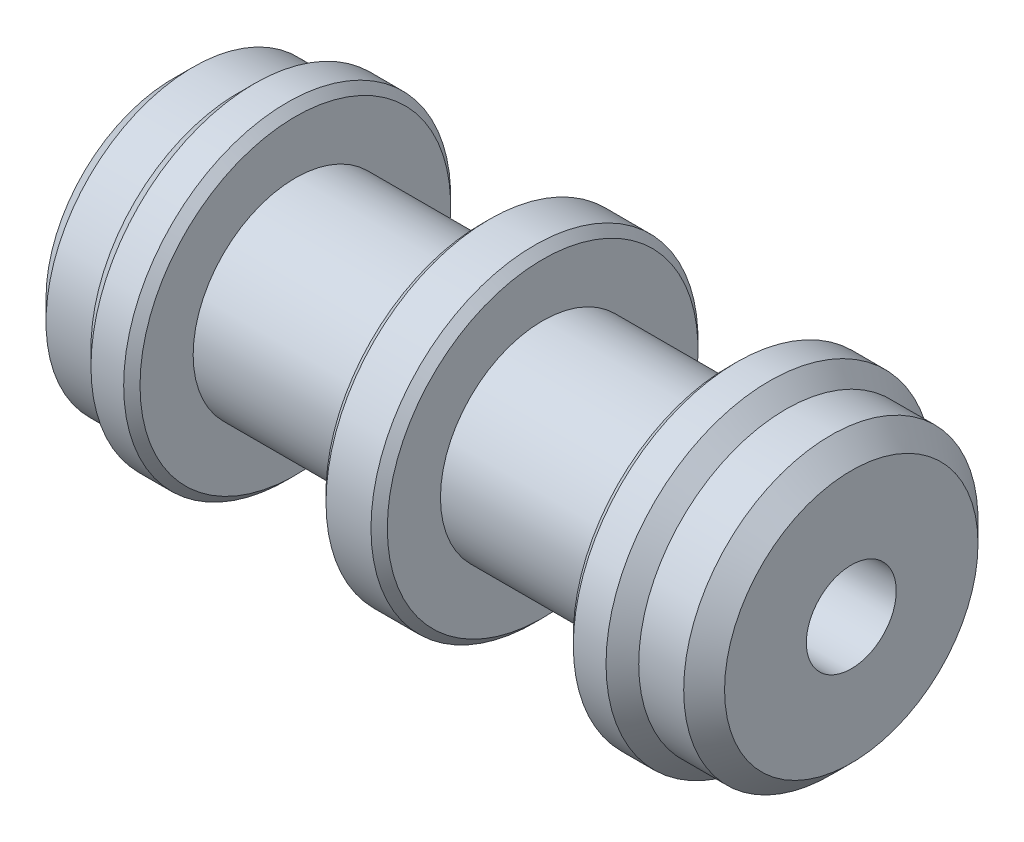
ISO-10303-21;
HEADER;
FILE_DESCRIPTION(('STEP AP214'),'2;1');
FILE_NAME('part.step','',(''),(''),'','','');
FILE_SCHEMA(('AUTOMOTIVE_DESIGN { 1 0 10303 214 1 1 1 1 }'));
ENDSEC;
DATA;
#1=APPLICATION_CONTEXT('core data for automotive mechanical design processes');
#2=APPLICATION_PROTOCOL_DEFINITION('international standard','automotive_design',2000,#1);
#3=PRODUCT_CONTEXT('',#1,'mechanical');
#4=PRODUCT('Part','Part','',(#3));
#5=PRODUCT_RELATED_PRODUCT_CATEGORY('part','',(#4));
#6=PRODUCT_DEFINITION_FORMATION('','',#4);
#7=PRODUCT_DEFINITION_CONTEXT('part definition',#1,'design');
#8=PRODUCT_DEFINITION('design','',#6,#7);
#9=PRODUCT_DEFINITION_SHAPE('','',#8);
#10=(LENGTH_UNIT() NAMED_UNIT(*) SI_UNIT(.MILLI.,.METRE.));
#11=(NAMED_UNIT(*) PLANE_ANGLE_UNIT() SI_UNIT($,.RADIAN.));
#12=(NAMED_UNIT(*) SI_UNIT($,.STERADIAN.) SOLID_ANGLE_UNIT());
#13=UNCERTAINTY_MEASURE_WITH_UNIT(LENGTH_MEASURE(1.E-05),#10,'distance_accuracy_value','');
#14=(GEOMETRIC_REPRESENTATION_CONTEXT(3) GLOBAL_UNCERTAINTY_ASSIGNED_CONTEXT((#13)) GLOBAL_UNIT_ASSIGNED_CONTEXT((#10,
#11,#12)) REPRESENTATION_CONTEXT('',''));
#15=CARTESIAN_POINT('',(0.,0.,0.));
#16=DIRECTION('',(0.,0.,1.));
#17=DIRECTION('',(1.,0.,0.));
#18=AXIS2_PLACEMENT_3D('',#15,#16,#17);
#19=CARTESIAN_POINT('',(-7.8,0.,0.));
#20=DIRECTION('',(-1.,0.,0.));
#21=DIRECTION('',(0.,0.,1.));
#22=AXIS2_PLACEMENT_3D('',#19,#20,#21);
#23=CYLINDRICAL_SURFACE('',#22,4.);
#24=CARTESIAN_POINT('',(-0.550000000032469,0.,0.));
#25=DIRECTION('',(1.,0.,0.));
#26=DIRECTION('',(0.,0.,-1.));
#27=AXIS2_PLACEMENT_3D('',#24,#25,#26);
#28=CIRCLE('',#27,3.99999999990541);
#29=CARTESIAN_POINT('',(-0.550000000032469,0.,-3.99999999990541));
#30=VERTEX_POINT('',#29);
#31=EDGE_CURVE('E69',#30,#30,#28,.F.);
#32=ORIENTED_EDGE('',*,*,#31,.F.);
#33=EDGE_LOOP('',(#32));
#34=FACE_BOUND('',#33,.T.);
#35=CARTESIAN_POINT('',(0.550000000032469,0.,0.));
#36=DIRECTION('',(-1.,0.,0.));
#37=DIRECTION('',(0.,0.,1.));
#38=AXIS2_PLACEMENT_3D('',#35,#36,#37);
#39=CIRCLE('',#38,3.99999999990541);
#40=CARTESIAN_POINT('',(0.550000000032469,0.,3.99999999990541));
#41=VERTEX_POINT('',#40);
#42=EDGE_CURVE('E37',#41,#41,#39,.F.);
#43=ORIENTED_EDGE('',*,*,#42,.F.);
#44=EDGE_LOOP('',(#43));
#45=FACE_BOUND('',#44,.T.);
#46=ADVANCED_FACE('F22',(#34,#45),#23,.T.);
#47=CARTESIAN_POINT('',(0.550000000032469,0.,0.));
#48=DIRECTION('',(-1.,0.,0.));
#49=DIRECTION('',(0.,0.,1.));
#50=AXIS2_PLACEMENT_3D('',#47,#48,#49);
#51=CONICAL_SURFACE('',#50,3.99999999990541,0.785398163397448);
#52=ORIENTED_EDGE('',*,*,#42,.T.);
#53=EDGE_LOOP('',(#52));
#54=FACE_BOUND('',#53,.T.);
#55=CARTESIAN_POINT('',(0.749999999925421,0.,0.));
#56=DIRECTION('',(-1.,0.,0.));
#57=DIRECTION('',(0.,0.,1.));
#58=AXIS2_PLACEMENT_3D('',#55,#56,#57);
#59=CIRCLE('',#58,3.80000000001246);
#60=CARTESIAN_POINT('',(0.749999999925421,0.,3.80000000001246));
#61=VERTEX_POINT('',#60);
#62=EDGE_CURVE('E25',#61,#61,#59,.F.);
#63=ORIENTED_EDGE('',*,*,#62,.F.);
#64=EDGE_LOOP('',(#63));
#65=FACE_BOUND('',#64,.T.);
#66=ADVANCED_FACE('F293',(#54,#65),#51,.T.);
#67=CARTESIAN_POINT('',(-0.550000000032469,0.,0.));
#68=DIRECTION('',(1.,0.,0.));
#69=DIRECTION('',(0.,0.,-1.));
#70=AXIS2_PLACEMENT_3D('',#67,#68,#69);
#71=CONICAL_SURFACE('',#70,3.99999999990541,0.785398163397448);
#72=ORIENTED_EDGE('',*,*,#31,.T.);
#73=EDGE_LOOP('',(#72));
#74=FACE_BOUND('',#73,.T.);
#75=CARTESIAN_POINT('',(-0.749999999925421,0.,0.));
#76=DIRECTION('',(1.,0.,0.));
#77=DIRECTION('',(0.,0.,-1.));
#78=AXIS2_PLACEMENT_3D('',#75,#76,#77);
#79=CIRCLE('',#78,3.80000000001246);
#80=CARTESIAN_POINT('',(-0.749999999925421,0.,-3.80000000001246));
#81=VERTEX_POINT('',#80);
#82=EDGE_CURVE('E64',#81,#81,#79,.T.);
#83=ORIENTED_EDGE('',*,*,#82,.T.);
#84=EDGE_LOOP('',(#83));
#85=FACE_BOUND('',#84,.T.);
#86=ADVANCED_FACE('F285',(#74,#85),#71,.T.);
#87=CARTESIAN_POINT('',(0.75,0.,0.));
#88=DIRECTION('',(1.,0.,0.));
#89=DIRECTION('',(0.,0.,-1.));
#90=AXIS2_PLACEMENT_3D('',#87,#88,#89);
#91=PLANE('',#90);
#92=ORIENTED_EDGE('',*,*,#62,.T.);
#93=EDGE_LOOP('',(#92));
#94=FACE_BOUND('',#93,.T.);
#95=CARTESIAN_POINT('',(0.750000000000001,0.,0.));
#96=DIRECTION('',(1.,0.,0.));
#97=DIRECTION('',(0.,0.,-1.));
#98=AXIS2_PLACEMENT_3D('',#95,#96,#97);
#99=CIRCLE('',#98,2.5);
#100=CARTESIAN_POINT('',(0.750000000000001,0.,-2.5));
#101=VERTEX_POINT('',#100);
#102=EDGE_CURVE('E62',#101,#101,#99,.T.);
#103=ORIENTED_EDGE('',*,*,#102,.F.);
#104=EDGE_LOOP('',(#103));
#105=FACE_BOUND('',#104,.T.);
#106=ADVANCED_FACE('F276',(#94,#105),#91,.T.);
#107=CARTESIAN_POINT('',(-0.75,0.,0.));
#108=DIRECTION('',(1.,0.,0.));
#109=DIRECTION('',(0.,0.,-1.));
#110=AXIS2_PLACEMENT_3D('',#107,#108,#109);
#111=PLANE('',#110);
#112=ORIENTED_EDGE('',*,*,#82,.F.);
#113=EDGE_LOOP('',(#112));
#114=FACE_BOUND('',#113,.T.);
#115=CARTESIAN_POINT('',(-0.750000000000001,0.,0.));
#116=DIRECTION('',(1.,0.,0.));
#117=DIRECTION('',(0.,0.,-1.));
#118=AXIS2_PLACEMENT_3D('',#115,#116,#117);
#119=CIRCLE('',#118,2.5);
#120=CARTESIAN_POINT('',(-0.750000000000001,0.,-2.5));
#121=VERTEX_POINT('',#120);
#122=EDGE_CURVE('E59',#121,#121,#119,.F.);
#123=ORIENTED_EDGE('',*,*,#122,.F.);
#124=EDGE_LOOP('',(#123));
#125=FACE_BOUND('',#124,.T.);
#126=ADVANCED_FACE('F267',(#114,#125),#111,.F.);
#127=CARTESIAN_POINT('',(-9.13,0.,0.));
#128=DIRECTION('',(1.,0.,0.));
#129=DIRECTION('',(0.,0.,-1.));
#130=AXIS2_PLACEMENT_3D('',#127,#128,#129);
#131=CYLINDRICAL_SURFACE('',#130,2.5);
#132=ORIENTED_EDGE('',*,*,#102,.T.);
#133=EDGE_LOOP('',(#132));
#134=FACE_BOUND('',#133,.T.);
#135=CARTESIAN_POINT('',(5.3,0.,0.));
#136=DIRECTION('',(1.,0.,0.));
#137=DIRECTION('',(0.,0.,-1.));
#138=AXIS2_PLACEMENT_3D('',#135,#136,#137);
#139=CIRCLE('',#138,2.5);
#140=CARTESIAN_POINT('',(5.3,0.,-2.5));
#141=VERTEX_POINT('',#140);
#142=EDGE_CURVE('E56',#141,#141,#139,.T.);
#143=ORIENTED_EDGE('',*,*,#142,.F.);
#144=EDGE_LOOP('',(#143));
#145=FACE_BOUND('',#144,.T.);
#146=ADVANCED_FACE('F258',(#134,#145),#131,.T.);
#147=CARTESIAN_POINT('',(-9.13,0.,0.));
#148=DIRECTION('',(1.,0.,0.));
#149=DIRECTION('',(0.,0.,-1.));
#150=AXIS2_PLACEMENT_3D('',#147,#148,#149);
#151=CYLINDRICAL_SURFACE('',#150,2.5);
#152=ORIENTED_EDGE('',*,*,#122,.T.);
#153=EDGE_LOOP('',(#152));
#154=FACE_BOUND('',#153,.T.);
#155=CARTESIAN_POINT('',(-5.3,0.,0.));
#156=DIRECTION('',(1.,0.,0.));
#157=DIRECTION('',(0.,0.,-1.));
#158=AXIS2_PLACEMENT_3D('',#155,#156,#157);
#159=CIRCLE('',#158,2.5);
#160=CARTESIAN_POINT('',(-5.3,0.,-2.5));
#161=VERTEX_POINT('',#160);
#162=EDGE_CURVE('E53',#161,#161,#159,.T.);
#163=ORIENTED_EDGE('',*,*,#162,.T.);
#164=EDGE_LOOP('',(#163));
#165=FACE_BOUND('',#164,.T.);
#166=ADVANCED_FACE('F249',(#154,#165),#151,.T.);
#167=CARTESIAN_POINT('',(5.3,0.,0.));
#168=DIRECTION('',(-1.,0.,0.));
#169=DIRECTION('',(0.,0.,1.));
#170=AXIS2_PLACEMENT_3D('',#167,#168,#169);
#171=PLANE('',#170);
#172=CARTESIAN_POINT('',(5.29999999992015,0.,0.));
#173=DIRECTION('',(1.,0.,0.));
#174=DIRECTION('',(0.,0.,-1.));
#175=AXIS2_PLACEMENT_3D('',#172,#173,#174);
#176=CIRCLE('',#175,3.79999999995562);
#177=CARTESIAN_POINT('',(5.29999999992015,0.,-3.79999999995562));
#178=VERTEX_POINT('',#177);
#179=EDGE_CURVE('E50',#178,#178,#176,.T.);
#180=ORIENTED_EDGE('',*,*,#179,.F.);
#181=EDGE_LOOP('',(#180));
#182=FACE_BOUND('',#181,.T.);
#183=ORIENTED_EDGE('',*,*,#142,.T.);
#184=EDGE_LOOP('',(#183));
#185=FACE_BOUND('',#184,.T.);
#186=ADVANCED_FACE('F240',(#182,#185),#171,.T.);
#187=CARTESIAN_POINT('',(-5.3,0.,0.));
#188=DIRECTION('',(-1.,0.,0.));
#189=DIRECTION('',(0.,0.,1.));
#190=AXIS2_PLACEMENT_3D('',#187,#188,#189);
#191=PLANE('',#190);
#192=CARTESIAN_POINT('',(-5.29999999992015,0.,0.));
#193=DIRECTION('',(-1.,0.,0.));
#194=DIRECTION('',(0.,0.,1.));
#195=AXIS2_PLACEMENT_3D('',#192,#193,#194);
#196=CIRCLE('',#195,3.79999999995562);
#197=CARTESIAN_POINT('',(-5.29999999992015,0.,3.79999999995562));
#198=VERTEX_POINT('',#197);
#199=EDGE_CURVE('E46',#198,#198,#196,.T.);
#200=ORIENTED_EDGE('',*,*,#199,.F.);
#201=EDGE_LOOP('',(#200));
#202=FACE_BOUND('',#201,.T.);
#203=ORIENTED_EDGE('',*,*,#162,.F.);
#204=EDGE_LOOP('',(#203));
#205=FACE_BOUND('',#204,.T.);
#206=ADVANCED_FACE('F231',(#202,#205),#191,.F.);
#207=CARTESIAN_POINT('',(5.49999999992679,0.,0.));
#208=DIRECTION('',(1.,0.,0.));
#209=DIRECTION('',(0.,0.,-1.));
#210=AXIS2_PLACEMENT_3D('',#207,#208,#209);
#211=CONICAL_SURFACE('',#210,4.0000000000191,0.785398163539557);
#212=CARTESIAN_POINT('',(5.5,0.,0.));
#213=DIRECTION('',(-1.,0.,0.));
#214=DIRECTION('',(0.,0.,1.));
#215=AXIS2_PLACEMENT_3D('',#212,#213,#214);
#216=CIRCLE('',#215,4.);
#217=CARTESIAN_POINT('',(5.5,0.,4.));
#218=VERTEX_POINT('',#217);
#219=EDGE_CURVE('E49',#218,#218,#216,.F.);
#220=ORIENTED_EDGE('',*,*,#219,.F.);
#221=EDGE_LOOP('',(#220));
#222=FACE_BOUND('',#221,.T.);
#223=ORIENTED_EDGE('',*,*,#179,.T.);
#224=EDGE_LOOP('',(#223));
#225=FACE_BOUND('',#224,.T.);
#226=ADVANCED_FACE('F222',(#222,#225),#211,.T.);
#227=CARTESIAN_POINT('',(-5.49999999992679,0.,0.));
#228=DIRECTION('',(-1.,0.,0.));
#229=DIRECTION('',(0.,0.,1.));
#230=AXIS2_PLACEMENT_3D('',#227,#228,#229);
#231=CONICAL_SURFACE('',#230,4.0000000000191,0.785398163539557);
#232=CARTESIAN_POINT('',(-5.5,0.,0.));
#233=DIRECTION('',(-1.,0.,0.));
#234=DIRECTION('',(0.,0.,1.));
#235=AXIS2_PLACEMENT_3D('',#232,#233,#234);
#236=CIRCLE('',#235,4.);
#237=CARTESIAN_POINT('',(-5.5,0.,4.));
#238=VERTEX_POINT('',#237);
#239=EDGE_CURVE('E79',#238,#238,#236,.T.);
#240=ORIENTED_EDGE('',*,*,#239,.F.);
#241=EDGE_LOOP('',(#240));
#242=FACE_BOUND('',#241,.T.);
#243=ORIENTED_EDGE('',*,*,#199,.T.);
#244=EDGE_LOOP('',(#243));
#245=FACE_BOUND('',#244,.T.);
#246=ADVANCED_FACE('F213',(#242,#245),#231,.T.);
#247=CARTESIAN_POINT('',(-7.8,0.,0.));
#248=DIRECTION('',(-1.,0.,0.));
#249=DIRECTION('',(0.,0.,1.));
#250=AXIS2_PLACEMENT_3D('',#247,#248,#249);
#251=CYLINDRICAL_SURFACE('',#250,4.);
#252=ORIENTED_EDGE('',*,*,#219,.T.);
#253=EDGE_LOOP('',(#252));
#254=FACE_BOUND('',#253,.T.);
#255=CARTESIAN_POINT('',(6.30000000001019,0.,0.));
#256=DIRECTION('',(-1.,0.,0.));
#257=DIRECTION('',(0.,0.,1.));
#258=AXIS2_PLACEMENT_3D('',#255,#256,#257);
#259=CIRCLE('',#258,4.00000000007594);
#260=CARTESIAN_POINT('',(6.30000000001019,0.,4.00000000007594));
#261=VERTEX_POINT('',#260);
#262=EDGE_CURVE('E82',#261,#261,#259,.F.);
#263=ORIENTED_EDGE('',*,*,#262,.F.);
#264=EDGE_LOOP('',(#263));
#265=FACE_BOUND('',#264,.T.);
#266=ADVANCED_FACE('F204',(#254,#265),#251,.T.);
#267=CARTESIAN_POINT('',(-7.8,0.,0.));
#268=DIRECTION('',(-1.,0.,0.));
#269=DIRECTION('',(0.,0.,1.));
#270=AXIS2_PLACEMENT_3D('',#267,#268,#269);
#271=CYLINDRICAL_SURFACE('',#270,4.);
#272=CARTESIAN_POINT('',(-6.30000000001019,0.,0.));
#273=DIRECTION('',(1.,0.,0.));
#274=DIRECTION('',(0.,0.,-1.));
#275=AXIS2_PLACEMENT_3D('',#272,#273,#274);
#276=CIRCLE('',#275,4.00000000007594);
#277=CARTESIAN_POINT('',(-6.30000000001019,0.,-4.00000000007594));
#278=VERTEX_POINT('',#277);
#279=EDGE_CURVE('E85',#278,#278,#276,.F.);
#280=ORIENTED_EDGE('',*,*,#279,.F.);
#281=EDGE_LOOP('',(#280));
#282=FACE_BOUND('',#281,.T.);
#283=ORIENTED_EDGE('',*,*,#239,.T.);
#284=EDGE_LOOP('',(#283));
#285=FACE_BOUND('',#284,.T.);
#286=ADVANCED_FACE('F195',(#282,#285),#271,.T.);
#287=CARTESIAN_POINT('',(6.30000000012387,0.,0.));
#288=DIRECTION('',(-1.,0.,0.));
#289=DIRECTION('',(0.,0.,1.));
#290=AXIS2_PLACEMENT_3D('',#287,#288,#289);
#291=CONICAL_SURFACE('',#290,3.99999999996226,0.785398163397448);
#292=ORIENTED_EDGE('',*,*,#262,.T.);
#293=EDGE_LOOP('',(#292));
#294=FACE_BOUND('',#293,.T.);
#295=CARTESIAN_POINT('',(6.7,0.,0.));
#296=DIRECTION('',(1.,0.,0.));
#297=DIRECTION('',(0.,0.,-1.));
#298=AXIS2_PLACEMENT_3D('',#295,#296,#297);
#299=CIRCLE('',#298,3.6);
#300=CARTESIAN_POINT('',(6.7,0.,-3.6));
#301=VERTEX_POINT('',#300);
#302=EDGE_CURVE('E88',#301,#301,#299,.T.);
#303=ORIENTED_EDGE('',*,*,#302,.F.);
#304=EDGE_LOOP('',(#303));
#305=FACE_BOUND('',#304,.T.);
#306=ADVANCED_FACE('F186',(#294,#305),#291,.T.);
#307=CARTESIAN_POINT('',(-6.30000000012387,0.,0.));
#308=DIRECTION('',(1.,0.,0.));
#309=DIRECTION('',(0.,0.,-1.));
#310=AXIS2_PLACEMENT_3D('',#307,#308,#309);
#311=CONICAL_SURFACE('',#310,3.99999999996226,0.785398163397448);
#312=ORIENTED_EDGE('',*,*,#279,.T.);
#313=EDGE_LOOP('',(#312));
#314=FACE_BOUND('',#313,.T.);
#315=CARTESIAN_POINT('',(-6.7,0.,0.));
#316=DIRECTION('',(1.,0.,0.));
#317=DIRECTION('',(0.,0.,-1.));
#318=AXIS2_PLACEMENT_3D('',#315,#316,#317);
#319=CIRCLE('',#318,3.6);
#320=CARTESIAN_POINT('',(-6.7,0.,-3.6));
#321=VERTEX_POINT('',#320);
#322=EDGE_CURVE('E91',#321,#321,#319,.F.);
#323=ORIENTED_EDGE('',*,*,#322,.F.);
#324=EDGE_LOOP('',(#323));
#325=FACE_BOUND('',#324,.T.);
#326=ADVANCED_FACE('F116',(#314,#325),#311,.T.);
#327=CARTESIAN_POINT('',(7.8,0.,0.));
#328=DIRECTION('',(1.,0.,0.));
#329=DIRECTION('',(0.,0.,-1.));
#330=AXIS2_PLACEMENT_3D('',#327,#328,#329);
#331=CYLINDRICAL_SURFACE('',#330,3.6);
#332=CARTESIAN_POINT('',(7.79999999991787,0.,0.));
#333=DIRECTION('',(-1.,0.,0.));
#334=DIRECTION('',(0.,0.,1.));
#335=AXIS2_PLACEMENT_3D('',#332,#333,#334);
#336=CIRCLE('',#335,3.60000000000582);
#337=CARTESIAN_POINT('',(7.79999999991787,0.,3.60000000000582));
#338=VERTEX_POINT('',#337);
#339=EDGE_CURVE('E94',#338,#338,#336,.F.);
#340=ORIENTED_EDGE('',*,*,#339,.F.);
#341=EDGE_LOOP('',(#340));
#342=FACE_BOUND('',#341,.T.);
#343=ORIENTED_EDGE('',*,*,#302,.T.);
#344=EDGE_LOOP('',(#343));
#345=FACE_BOUND('',#344,.T.);
#346=ADVANCED_FACE('F106',(#342,#345),#331,.T.);
#347=CARTESIAN_POINT('',(-7.8,0.,0.));
#348=DIRECTION('',(1.,0.,0.));
#349=DIRECTION('',(0.,0.,-1.));
#350=AXIS2_PLACEMENT_3D('',#347,#348,#349);
#351=CYLINDRICAL_SURFACE('',#350,3.6);
#352=ORIENTED_EDGE('',*,*,#322,.T.);
#353=EDGE_LOOP('',(#352));
#354=FACE_BOUND('',#353,.T.);
#355=CARTESIAN_POINT('',(-7.79999999991787,0.,0.));
#356=DIRECTION('',(1.,0.,0.));
#357=DIRECTION('',(0.,0.,-1.));
#358=AXIS2_PLACEMENT_3D('',#355,#356,#357);
#359=CIRCLE('',#358,3.60000000000582);
#360=CARTESIAN_POINT('',(-7.79999999991787,0.,-3.60000000000582));
#361=VERTEX_POINT('',#360);
#362=EDGE_CURVE('E45',#361,#361,#359,.F.);
#363=ORIENTED_EDGE('',*,*,#362,.F.);
#364=EDGE_LOOP('',(#363));
#365=FACE_BOUND('',#364,.T.);
#366=ADVANCED_FACE('F103',(#354,#365),#351,.T.);
#367=CARTESIAN_POINT('',(7.79999999991787,0.,0.));
#368=DIRECTION('',(-1.,0.,0.));
#369=DIRECTION('',(0.,0.,1.));
#370=AXIS2_PLACEMENT_3D('',#367,#368,#369);
#371=CONICAL_SURFACE('',#370,3.60000000000582,0.785398163397448);
#372=ORIENTED_EDGE('',*,*,#339,.T.);
#373=EDGE_LOOP('',(#372));
#374=FACE_BOUND('',#373,.T.);
#375=CARTESIAN_POINT('',(8.29999999996289,0.,0.));
#376=DIRECTION('',(-1.,0.,0.));
#377=DIRECTION('',(0.,0.,1.));
#378=AXIS2_PLACEMENT_3D('',#375,#376,#377);
#379=CIRCLE('',#378,3.0999999999608);
#380=CARTESIAN_POINT('',(8.29999999996289,0.,3.0999999999608));
#381=VERTEX_POINT('',#380);
#382=EDGE_CURVE('E42',#381,#381,#379,.F.);
#383=ORIENTED_EDGE('',*,*,#382,.F.);
#384=EDGE_LOOP('',(#383));
#385=FACE_BOUND('',#384,.T.);
#386=ADVANCED_FACE('F105',(#374,#385),#371,.T.);
#387=CARTESIAN_POINT('',(-7.79999999991787,0.,0.));
#388=DIRECTION('',(1.,0.,0.));
#389=DIRECTION('',(0.,0.,-1.));
#390=AXIS2_PLACEMENT_3D('',#387,#388,#389);
#391=CONICAL_SURFACE('',#390,3.60000000000582,0.785398163397448);
#392=ORIENTED_EDGE('',*,*,#362,.T.);
#393=EDGE_LOOP('',(#392));
#394=FACE_BOUND('',#393,.T.);
#395=CARTESIAN_POINT('',(-8.29999999996289,0.,0.));
#396=DIRECTION('',(1.,0.,0.));
#397=DIRECTION('',(0.,0.,-1.));
#398=AXIS2_PLACEMENT_3D('',#395,#396,#397);
#399=CIRCLE('',#398,3.0999999999608);
#400=CARTESIAN_POINT('',(-8.29999999996289,0.,-3.0999999999608));
#401=VERTEX_POINT('',#400);
#402=EDGE_CURVE('E34',#401,#401,#399,.T.);
#403=ORIENTED_EDGE('',*,*,#402,.T.);
#404=EDGE_LOOP('',(#403));
#405=FACE_BOUND('',#404,.T.);
#406=ADVANCED_FACE('F100',(#394,#405),#391,.T.);
#407=CARTESIAN_POINT('',(8.3,0.,0.));
#408=DIRECTION('',(1.,0.,0.));
#409=DIRECTION('',(0.,0.,-1.));
#410=AXIS2_PLACEMENT_3D('',#407,#408,#409);
#411=PLANE('',#410);
#412=ORIENTED_EDGE('',*,*,#382,.T.);
#413=EDGE_LOOP('',(#412));
#414=FACE_BOUND('',#413,.T.);
#415=CARTESIAN_POINT('',(8.3,0.,0.));
#416=DIRECTION('',(1.,0.,0.));
#417=DIRECTION('',(0.,0.,-1.));
#418=AXIS2_PLACEMENT_3D('',#415,#416,#417);
#419=CIRCLE('',#418,1.1);
#420=CARTESIAN_POINT('',(8.3,0.,-1.1));
#421=VERTEX_POINT('',#420);
#422=EDGE_CURVE('E29',#421,#421,#419,.F.);
#423=ORIENTED_EDGE('',*,*,#422,.T.);
#424=EDGE_LOOP('',(#423));
#425=FACE_BOUND('',#424,.T.);
#426=ADVANCED_FACE('F127',(#414,#425),#411,.T.);
#427=CARTESIAN_POINT('',(-8.3,0.,0.));
#428=DIRECTION('',(1.,0.,0.));
#429=DIRECTION('',(0.,0.,-1.));
#430=AXIS2_PLACEMENT_3D('',#427,#428,#429);
#431=PLANE('',#430);
#432=ORIENTED_EDGE('',*,*,#402,.F.);
#433=EDGE_LOOP('',(#432));
#434=FACE_BOUND('',#433,.T.);
#435=CARTESIAN_POINT('',(-8.3,0.,0.));
#436=DIRECTION('',(1.,0.,0.));
#437=DIRECTION('',(0.,0.,-1.));
#438=AXIS2_PLACEMENT_3D('',#435,#436,#437);
#439=CIRCLE('',#438,1.1);
#440=CARTESIAN_POINT('',(-8.3,0.,-1.1));
#441=VERTEX_POINT('',#440);
#442=EDGE_CURVE('E12',#441,#441,#439,.T.);
#443=ORIENTED_EDGE('',*,*,#442,.T.);
#444=EDGE_LOOP('',(#443));
#445=FACE_BOUND('',#444,.T.);
#446=ADVANCED_FACE('F121',(#434,#445),#431,.F.);
#447=CARTESIAN_POINT('',(8.3,0.,0.));
#448=DIRECTION('',(1.,0.,0.));
#449=DIRECTION('',(0.,0.,-1.));
#450=AXIS2_PLACEMENT_3D('',#447,#448,#449);
#451=CYLINDRICAL_SURFACE('',#450,1.1);
#452=ORIENTED_EDGE('',*,*,#442,.F.);
#453=EDGE_LOOP('',(#452));
#454=FACE_BOUND('',#453,.T.);
#455=ORIENTED_EDGE('',*,*,#422,.F.);
#456=EDGE_LOOP('',(#455));
#457=FACE_BOUND('',#456,.T.);
#458=ADVANCED_FACE('F119',(#454,#457),#451,.F.);
#459=CLOSED_SHELL('',(#46,#66,#86,#106,#126,#146,#166,#186,#206,#226,#246,#266,#286,#306,#326,
#346,#366,#386,#406,#426,#446,#458));
#460=MANIFOLD_SOLID_BREP('B1',#459);
#461=ADVANCED_BREP_SHAPE_REPRESENTATION('',(#18,#460),#14);
#462=SHAPE_DEFINITION_REPRESENTATION(#9,#461);
ENDSEC;
END-ISO-10303-21;
